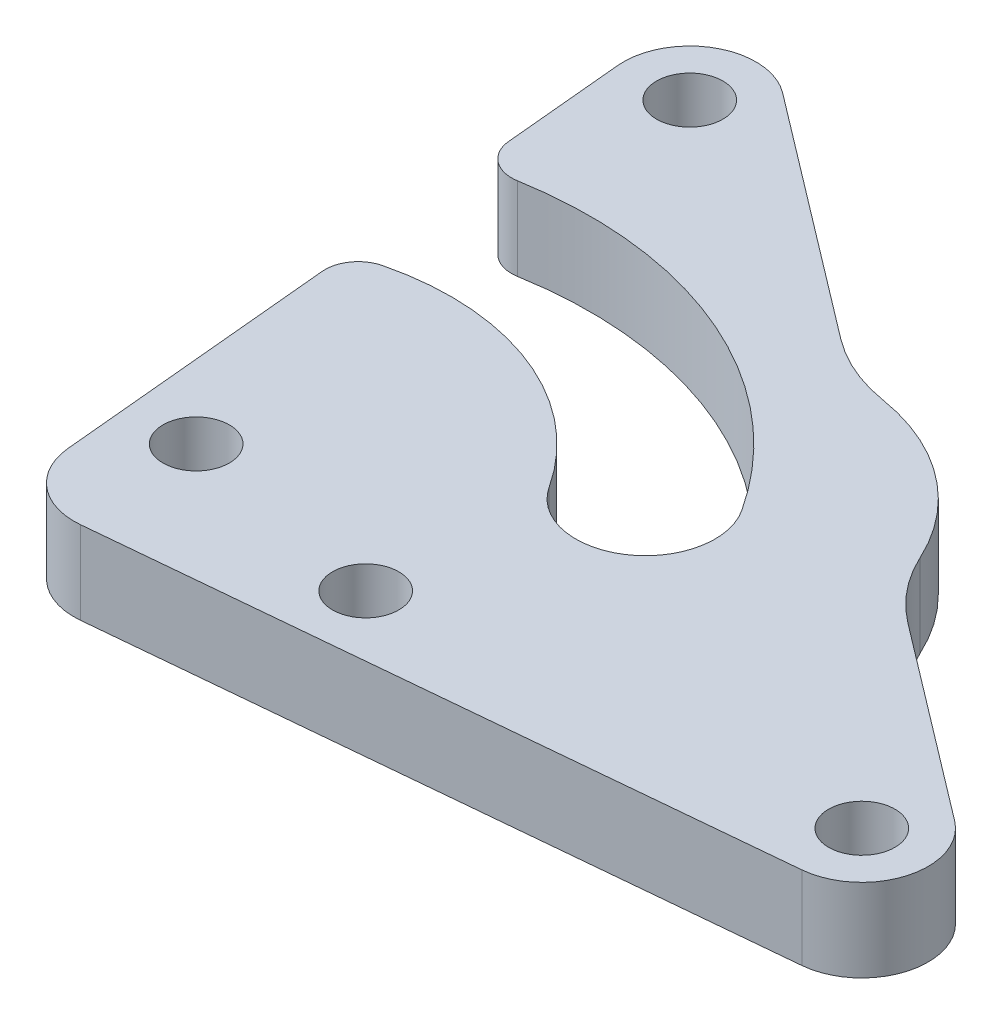
ISO-10303-21;
HEADER;
FILE_DESCRIPTION(('STEP AP214'),'2;1');
FILE_NAME('part.step','',(''),(''),'','','');
FILE_SCHEMA(('AUTOMOTIVE_DESIGN { 1 0 10303 214 1 1 1 1 }'));
ENDSEC;
DATA;
#1=APPLICATION_CONTEXT('core data for automotive mechanical design processes');
#2=APPLICATION_PROTOCOL_DEFINITION('international standard','automotive_design',2000,#1);
#3=PRODUCT_CONTEXT('',#1,'mechanical');
#4=PRODUCT('Part','Part','',(#3));
#5=PRODUCT_RELATED_PRODUCT_CATEGORY('part','',(#4));
#6=PRODUCT_DEFINITION_FORMATION('','',#4);
#7=PRODUCT_DEFINITION_CONTEXT('part definition',#1,'design');
#8=PRODUCT_DEFINITION('design','',#6,#7);
#9=PRODUCT_DEFINITION_SHAPE('','',#8);
#10=(LENGTH_UNIT() NAMED_UNIT(*) SI_UNIT(.MILLI.,.METRE.));
#11=(NAMED_UNIT(*) PLANE_ANGLE_UNIT() SI_UNIT($,.RADIAN.));
#12=(NAMED_UNIT(*) SI_UNIT($,.STERADIAN.) SOLID_ANGLE_UNIT());
#13=UNCERTAINTY_MEASURE_WITH_UNIT(LENGTH_MEASURE(1.E-05),#10,'distance_accuracy_value','');
#14=(GEOMETRIC_REPRESENTATION_CONTEXT(3) GLOBAL_UNCERTAINTY_ASSIGNED_CONTEXT((#13)) GLOBAL_UNIT_ASSIGNED_CONTEXT((#10,
#11,#12)) REPRESENTATION_CONTEXT('',''));
#15=CARTESIAN_POINT('',(0.,0.,0.));
#16=DIRECTION('',(0.,0.,1.));
#17=DIRECTION('',(1.,0.,0.));
#18=AXIS2_PLACEMENT_3D('',#15,#16,#17);
#19=CARTESIAN_POINT('',(9.77368523942251,5.,-12.861532423352));
#20=DIRECTION('',(0.605040910881647,0.,-0.796194383401131));
#21=DIRECTION('',(-0.796194383401131,0.,-0.605040910881647));
#22=AXIS2_PLACEMENT_3D('',#19,#20,#21);
#23=PLANE('',#22);
#24=DIRECTION('',(0.796194383401131,0.,0.605040910881647));
#25=VECTOR('',#24,1.);
#26=CARTESIAN_POINT('',(9.77368523942251,5.,-12.861532423352));
#27=LINE('',#26,#25);
#28=CARTESIAN_POINT('',(-20.7448000403564,5.,-36.0530199763391));
#29=VERTEX_POINT('',#28);
#30=CARTESIAN_POINT('',(-6.11267169070397,5.,-24.9338304299459));
#31=VERTEX_POINT('',#30);
#32=EDGE_CURVE('E207',#29,#31,#27,.T.);
#33=ORIENTED_EDGE('',*,*,#32,.T.);
#34=DIRECTION('',(0.,-1.,0.));
#35=VECTOR('',#34,1.);
#36=CARTESIAN_POINT('',(-6.11267169070397,0.,-24.9338304299459));
#37=LINE('',#36,#35);
#38=CARTESIAN_POINT('',(-6.11267169070397,0.,-24.9338304299459));
#39=VERTEX_POINT('',#38);
#40=EDGE_CURVE('E264',#31,#39,#37,.T.);
#41=ORIENTED_EDGE('',*,*,#40,.T.);
#42=DIRECTION('',(0.796194383401131,0.,0.605040910881647));
#43=VECTOR('',#42,1.);
#44=CARTESIAN_POINT('',(9.77368523942251,0.,-12.861532423352));
#45=LINE('',#44,#43);
#46=CARTESIAN_POINT('',(-20.7448000403564,0.,-36.0530199763391));
#47=VERTEX_POINT('',#46);
#48=EDGE_CURVE('E231',#47,#39,#45,.T.);
#49=ORIENTED_EDGE('',*,*,#48,.F.);
#50=DIRECTION('',(0.,-1.,0.));
#51=VECTOR('',#50,1.);
#52=CARTESIAN_POINT('',(-20.7448000403564,5.,-36.0530199763391));
#53=LINE('',#52,#51);
#54=EDGE_CURVE('E257',#29,#47,#53,.T.);
#55=ORIENTED_EDGE('',*,*,#54,.F.);
#56=EDGE_LOOP('',(#33,#41,#49,#55));
#57=FACE_BOUND('',#56,.T.);
#58=ADVANCED_FACE('F36',(#57),#23,.T.);
#59=CARTESIAN_POINT('',(-23.8955117873169,5.,2.23734414340496));
#60=DIRECTION('',(-0.995645293915383,0.,0.0932225761505825));
#61=DIRECTION('',(0.0932225761505825,0.,0.995645293915383));
#62=AXIS2_PLACEMENT_3D('',#59,#60,#61);
#63=PLANE('',#62);
#64=DIRECTION('',(-0.0932225761505825,0.,-0.995645293915383));
#65=VECTOR('',#64,1.);
#66=CARTESIAN_POINT('',(-23.8955117873169,5.,2.23734414340496));
#67=LINE('',#66,#65);
#68=CARTESIAN_POINT('',(-23.7209626279776,5.,4.10158193031544));
#69=VERTEX_POINT('',#68);
#70=CARTESIAN_POINT('',(-25.3052715150428,5.,-12.8193159106408));
#71=VERTEX_POINT('',#70);
#72=EDGE_CURVE('E215',#69,#71,#67,.T.);
#73=ORIENTED_EDGE('',*,*,#72,.T.);
#74=DIRECTION('',(0.,1.,0.));
#75=VECTOR('',#74,1.);
#76=CARTESIAN_POINT('',(-25.3052715150428,5.,-12.8193159106408));
#77=LINE('',#76,#75);
#78=CARTESIAN_POINT('',(-25.3052715150428,0.,-12.8193159106408));
#79=VERTEX_POINT('',#78);
#80=EDGE_CURVE('E277',#71,#79,#77,.F.);
#81=ORIENTED_EDGE('',*,*,#80,.T.);
#82=DIRECTION('',(-0.0932225761505825,0.,-0.995645293915383));
#83=VECTOR('',#82,1.);
#84=CARTESIAN_POINT('',(-23.8955117873169,0.,2.23734414340496));
#85=LINE('',#84,#83);
#86=CARTESIAN_POINT('',(-23.7209626279776,0.,4.10158193031544));
#87=VERTEX_POINT('',#86);
#88=EDGE_CURVE('E238',#87,#79,#85,.T.);
#89=ORIENTED_EDGE('',*,*,#88,.F.);
#90=DIRECTION('',(0.,1.,0.));
#91=VECTOR('',#90,1.);
#92=CARTESIAN_POINT('',(-23.7209626279776,0.,4.10158193031544));
#93=LINE('',#92,#91);
#94=EDGE_CURVE('E194',#87,#69,#93,.T.);
#95=ORIENTED_EDGE('',*,*,#94,.T.);
#96=EDGE_LOOP('',(#73,#81,#89,#95));
#97=FACE_BOUND('',#96,.T.);
#98=ADVANCED_FACE('F307',(#97),#63,.T.);
#99=CARTESIAN_POINT('',(0.,5.,0.));
#100=DIRECTION('',(0.,1.,0.));
#101=DIRECTION('',(0.,0.,1.));
#102=AXIS2_PLACEMENT_3D('',#99,#100,#101);
#103=PLANE('',#102);
#104=CARTESIAN_POINT('',(-7.29280895681746,5.,2.56347693996325));
#105=DIRECTION('',(0.,1.,0.));
#106=DIRECTION('',(0.,0.,1.));
#107=AXIS2_PLACEMENT_3D('',#104,#105,#106);
#108=CIRCLE('',#107,2.);
#109=CARTESIAN_POINT('',(-7.29280895681746,5.,4.56347693996326));
#110=VERTEX_POINT('',#109);
#111=EDGE_CURVE('E345',#110,#110,#108,.T.);
#112=ORIENTED_EDGE('',*,*,#111,.F.);
#113=EDGE_LOOP('',(#112));
#114=FACE_BOUND('',#113,.T.);
#115=CARTESIAN_POINT('',(-20.0875,5.,0.));
#116=DIRECTION('',(0.,1.,0.));
#117=DIRECTION('',(0.,0.,1.));
#118=AXIS2_PLACEMENT_3D('',#115,#116,#117);
#119=CIRCLE('',#118,2.);
#120=CARTESIAN_POINT('',(-20.0875,5.,1.99999999999999));
#121=VERTEX_POINT('',#120);
#122=EDGE_CURVE('E221',#121,#121,#119,.T.);
#123=ORIENTED_EDGE('',*,*,#122,.F.);
#124=EDGE_LOOP('',(#123));
#125=FACE_BOUND('',#124,.T.);
#126=CARTESIAN_POINT('',(20.0875,5.,0.));
#127=DIRECTION('',(0.,1.,0.));
#128=DIRECTION('',(0.,0.,1.));
#129=AXIS2_PLACEMENT_3D('',#126,#127,#128);
#130=CIRCLE('',#129,2.);
#131=CARTESIAN_POINT('',(20.0875,5.,1.99999999999999));
#132=VERTEX_POINT('',#131);
#133=EDGE_CURVE('E224',#132,#132,#130,.T.);
#134=ORIENTED_EDGE('',*,*,#133,.F.);
#135=EDGE_LOOP('',(#134));
#136=FACE_BOUND('',#135,.T.);
#137=CARTESIAN_POINT('',(-23.164963683883,5.,-32.8682424427346));
#138=DIRECTION('',(0.,1.,0.));
#139=DIRECTION('',(0.,0.,1.));
#140=AXIS2_PLACEMENT_3D('',#137,#138,#139);
#141=CIRCLE('',#140,2.);
#142=CARTESIAN_POINT('',(-23.164963683883,5.,-30.8682424427346));
#143=VERTEX_POINT('',#142);
#144=EDGE_CURVE('E227',#143,#143,#141,.T.);
#145=ORIENTED_EDGE('',*,*,#144,.F.);
#146=EDGE_LOOP('',(#145));
#147=FACE_BOUND('',#146,.T.);
#148=CARTESIAN_POINT('',(-20.0875,5.,0.));
#149=DIRECTION('',(0.,1.,0.));
#150=DIRECTION('',(0.,0.,1.));
#151=AXIS2_PLACEMENT_3D('',#148,#149,#150);
#152=CIRCLE('',#151,15.4);
#153=CARTESIAN_POINT('',(-7.1769141892076,5.,-8.39504461108851));
#154=VERTEX_POINT('',#153);
#155=CARTESIAN_POINT('',(-23.7955452447063,5.,-14.9469194305452));
#156=VERTEX_POINT('',#155);
#157=EDGE_CURVE('E156',#154,#156,#152,.T.);
#158=ORIENTED_EDGE('',*,*,#157,.T.);
#159=CARTESIAN_POINT('',(-23.313980927212,5.,-13.005761062942));
#160=DIRECTION('',(0.,1.,0.));
#161=DIRECTION('',(0.,0.,1.));
#162=AXIS2_PLACEMENT_3D('',#159,#160,#161);
#163=CIRCLE('',#162,2.);
#164=EDGE_CURVE('E286',#156,#71,#163,.T.);
#165=ORIENTED_EDGE('',*,*,#164,.T.);
#166=ORIENTED_EDGE('',*,*,#72,.F.);
#167=CARTESIAN_POINT('',(-19.7383814523161,5.,3.7286916257131));
#168=DIRECTION('',(0.,1.,0.));
#169=DIRECTION('',(0.,0.,1.));
#170=AXIS2_PLACEMENT_3D('',#167,#168,#169);
#171=CIRCLE('',#170,4.);
#172=CARTESIAN_POINT('',(-19.3655127528816,5.,7.71127482421405));
#173=VERTEX_POINT('',#172);
#174=EDGE_CURVE('E185',#69,#173,#171,.T.);
#175=ORIENTED_EDGE('',*,*,#174,.T.);
#176=DIRECTION('',(0.995645799625237,0.,-0.0932171748586161));
#177=VECTOR('',#176,1.);
#178=CARTESIAN_POINT('',(0.547417859354653,5.,5.84692995827176));
#179=LINE('',#178,#177);
#180=CARTESIAN_POINT('',(20.4603686994345,5.,3.98258319850094));
#181=VERTEX_POINT('',#180);
#182=EDGE_CURVE('E191',#173,#181,#179,.T.);
#183=ORIENTED_EDGE('',*,*,#182,.T.);
#184=CARTESIAN_POINT('',(20.0875,5.,0.));
#185=DIRECTION('',(0.,1.,0.));
#186=DIRECTION('',(0.,0.,1.));
#187=AXIS2_PLACEMENT_3D('',#184,#185,#186);
#188=CIRCLE('',#187,4.);
#189=CARTESIAN_POINT('',(22.5076636435266,5.,-3.18477753360454));
#190=VERTEX_POINT('',#189);
#191=EDGE_CURVE('E218',#181,#190,#188,.T.);
#192=ORIENTED_EDGE('',*,*,#191,.T.);
#193=CARTESIAN_POINT('',(10.7307844322284,5.,-12.1342173612366));
#194=VERTEX_POINT('',#193);
#195=EDGE_CURVE('E211',#194,#190,#27,.T.);
#196=ORIENTED_EDGE('',*,*,#195,.F.);
#197=CARTESIAN_POINT('',(16.7811935410449,5.,-20.0961611952479));
#198=DIRECTION('',(0.,1.,0.));
#199=DIRECTION('',(0.,0.,1.));
#200=AXIS2_PLACEMENT_3D('',#197,#198,#199);
#201=CIRCLE('',#200,10.);
#202=CARTESIAN_POINT('',(7.69806515314992,5.,-15.9132461006019));
#203=VERTEX_POINT('',#202);
#204=EDGE_CURVE('E273',#194,#203,#201,.F.);
#205=ORIENTED_EDGE('',*,*,#204,.T.);
#206=CARTESIAN_POINT('',(-3.65584533171876,5.,-10.6846022322945));
#207=DIRECTION('',(0.,1.,0.));
#208=DIRECTION('',(0.,0.,1.));
#209=AXIS2_PLACEMENT_3D('',#206,#207,#208);
#210=CIRCLE('',#209,12.5);
#211=CARTESIAN_POINT('',(-1.65941047070139,5.,-23.0241422498849));
#212=VERTEX_POINT('',#211);
#213=EDGE_CURVE('E178',#203,#212,#210,.T.);
#214=ORIENTED_EDGE('',*,*,#213,.T.);
#215=CARTESIAN_POINT('',(-0.0622625818874969,5.,-32.8957742639572));
#216=DIRECTION('',(0.,1.,0.));
#217=DIRECTION('',(0.,0.,1.));
#218=AXIS2_PLACEMENT_3D('',#215,#216,#217);
#219=CIRCLE('',#218,10.);
#220=EDGE_CURVE('E269',#212,#31,#219,.F.);
#221=ORIENTED_EDGE('',*,*,#220,.T.);
#222=ORIENTED_EDGE('',*,*,#32,.F.);
#223=CARTESIAN_POINT('',(-23.164963683883,5.,-32.8682424427346));
#224=DIRECTION('',(0.,1.,0.));
#225=DIRECTION('',(0.,0.,1.));
#226=AXIS2_PLACEMENT_3D('',#223,#224,#225);
#227=CIRCLE('',#226,4.);
#228=CARTESIAN_POINT('',(-27.1475448595446,5.,-32.4953521381323));
#229=VERTEX_POINT('',#228);
#230=EDGE_CURVE('E210',#29,#229,#227,.T.);
#231=ORIENTED_EDGE('',*,*,#230,.T.);
#232=CARTESIAN_POINT('',(-26.4679861947594,5.,-25.2374601717068));
#233=VERTEX_POINT('',#232);
#234=EDGE_CURVE('E214',#233,#229,#67,.T.);
#235=ORIENTED_EDGE('',*,*,#234,.F.);
#236=CARTESIAN_POINT('',(-24.4766956069286,5.,-25.4239053240079));
#237=DIRECTION('',(0.,1.,0.));
#238=DIRECTION('',(0.,0.,1.));
#239=AXIS2_PLACEMENT_3D('',#236,#237,#238);
#240=CIRCLE('',#239,2.);
#241=CARTESIAN_POINT('',(-24.1364478854613,5.,-23.4530599500538));
#242=VERTEX_POINT('',#241);
#243=EDGE_CURVE('E51',#233,#242,#240,.T.);
#244=ORIENTED_EDGE('',*,*,#243,.T.);
#245=CARTESIAN_POINT('',(-20.0875,5.,0.));
#246=DIRECTION('',(0.,1.,0.));
#247=DIRECTION('',(0.,0.,1.));
#248=AXIS2_PLACEMENT_3D('',#245,#246,#247);
#249=CIRCLE('',#248,23.8);
#250=CARTESIAN_POINT('',(-0.134776474229926,5.,-12.9741598535004));
#251=VERTEX_POINT('',#250);
#252=EDGE_CURVE('E173',#251,#242,#249,.T.);
#253=ORIENTED_EDGE('',*,*,#252,.F.);
#254=CARTESIAN_POINT('',(-3.65584533171876,5.,-10.6846022322945));
#255=DIRECTION('',(0.,1.,0.));
#256=DIRECTION('',(0.,0.,1.));
#257=AXIS2_PLACEMENT_3D('',#254,#255,#256);
#258=CIRCLE('',#257,4.2);
#259=EDGE_CURVE('E175',#154,#251,#258,.T.);
#260=ORIENTED_EDGE('',*,*,#259,.F.);
#261=EDGE_LOOP('',(#158,#165,#166,#175,#183,#192,#196,#205,#214,#221,#222,#231,#235,#244,#253,#260));
#262=FACE_BOUND('',#261,.T.);
#263=ADVANCED_FACE('F314',(#114,#125,#136,#147,#262),#103,.T.);
#264=CARTESIAN_POINT('',(0.,0.,0.));
#265=DIRECTION('',(0.,1.,0.));
#266=DIRECTION('',(0.,0.,1.));
#267=AXIS2_PLACEMENT_3D('',#264,#265,#266);
#268=PLANE('',#267);
#269=CARTESIAN_POINT('',(-7.29280895681746,0.,2.56347693996325));
#270=DIRECTION('',(0.,1.,0.));
#271=DIRECTION('',(0.,0.,1.));
#272=AXIS2_PLACEMENT_3D('',#269,#270,#271);
#273=CIRCLE('',#272,2.);
#274=CARTESIAN_POINT('',(-7.29280895681746,0.,4.56347693996326));
#275=VERTEX_POINT('',#274);
#276=EDGE_CURVE('E343',#275,#275,#273,.T.);
#277=ORIENTED_EDGE('',*,*,#276,.T.);
#278=EDGE_LOOP('',(#277));
#279=FACE_BOUND('',#278,.T.);
#280=CARTESIAN_POINT('',(-23.164963683883,0.,-32.8682424427346));
#281=DIRECTION('',(0.,1.,0.));
#282=DIRECTION('',(0.,0.,1.));
#283=AXIS2_PLACEMENT_3D('',#280,#281,#282);
#284=CIRCLE('',#283,2.);
#285=CARTESIAN_POINT('',(-23.164963683883,0.,-30.8682424427346));
#286=VERTEX_POINT('',#285);
#287=EDGE_CURVE('E249',#286,#286,#284,.T.);
#288=ORIENTED_EDGE('',*,*,#287,.T.);
#289=EDGE_LOOP('',(#288));
#290=FACE_BOUND('',#289,.T.);
#291=CARTESIAN_POINT('',(20.0875,0.,0.));
#292=DIRECTION('',(0.,1.,0.));
#293=DIRECTION('',(0.,0.,1.));
#294=AXIS2_PLACEMENT_3D('',#291,#292,#293);
#295=CIRCLE('',#294,2.);
#296=CARTESIAN_POINT('',(20.0875,0.,1.99999999999999));
#297=VERTEX_POINT('',#296);
#298=EDGE_CURVE('E246',#297,#297,#295,.T.);
#299=ORIENTED_EDGE('',*,*,#298,.T.);
#300=EDGE_LOOP('',(#299));
#301=FACE_BOUND('',#300,.T.);
#302=CARTESIAN_POINT('',(-20.0875,0.,0.));
#303=DIRECTION('',(0.,1.,0.));
#304=DIRECTION('',(0.,0.,1.));
#305=AXIS2_PLACEMENT_3D('',#302,#303,#304);
#306=CIRCLE('',#305,2.);
#307=CARTESIAN_POINT('',(-20.0875,0.,1.99999999999999));
#308=VERTEX_POINT('',#307);
#309=EDGE_CURVE('E243',#308,#308,#306,.T.);
#310=ORIENTED_EDGE('',*,*,#309,.T.);
#311=EDGE_LOOP('',(#310));
#312=FACE_BOUND('',#311,.T.);
#313=ORIENTED_EDGE('',*,*,#88,.T.);
#314=CARTESIAN_POINT('',(-23.313980927212,0.,-13.005761062942));
#315=DIRECTION('',(0.,1.,0.));
#316=DIRECTION('',(0.,0.,1.));
#317=AXIS2_PLACEMENT_3D('',#314,#315,#316);
#318=CIRCLE('',#317,2.);
#319=CARTESIAN_POINT('',(-23.7955452447063,0.,-14.9469194305452));
#320=VERTEX_POINT('',#319);
#321=EDGE_CURVE('E172',#79,#320,#318,.F.);
#322=ORIENTED_EDGE('',*,*,#321,.T.);
#323=CARTESIAN_POINT('',(-20.0875,0.,0.));
#324=DIRECTION('',(0.,1.,0.));
#325=DIRECTION('',(0.,0.,1.));
#326=AXIS2_PLACEMENT_3D('',#323,#324,#325);
#327=CIRCLE('',#326,15.4);
#328=CARTESIAN_POINT('',(-7.1769141892076,0.,-8.39504461108851));
#329=VERTEX_POINT('',#328);
#330=EDGE_CURVE('E153',#329,#320,#327,.T.);
#331=ORIENTED_EDGE('',*,*,#330,.F.);
#332=CARTESIAN_POINT('',(-3.65584533171876,0.,-10.6846022322945));
#333=DIRECTION('',(0.,1.,0.));
#334=DIRECTION('',(0.,0.,1.));
#335=AXIS2_PLACEMENT_3D('',#332,#333,#334);
#336=CIRCLE('',#335,4.2);
#337=CARTESIAN_POINT('',(-0.134776474229925,0.,-12.9741598535004));
#338=VERTEX_POINT('',#337);
#339=EDGE_CURVE('E165',#329,#338,#336,.T.);
#340=ORIENTED_EDGE('',*,*,#339,.T.);
#341=CARTESIAN_POINT('',(-20.0875,0.,0.));
#342=DIRECTION('',(0.,1.,0.));
#343=DIRECTION('',(0.,0.,1.));
#344=AXIS2_PLACEMENT_3D('',#341,#342,#343);
#345=CIRCLE('',#344,23.8);
#346=CARTESIAN_POINT('',(-24.1364478854613,0.,-23.4530599500538));
#347=VERTEX_POINT('',#346);
#348=EDGE_CURVE('E161',#338,#347,#345,.T.);
#349=ORIENTED_EDGE('',*,*,#348,.T.);
#350=CARTESIAN_POINT('',(-24.4766956069286,0.,-25.4239053240079));
#351=DIRECTION('',(0.,1.,0.));
#352=DIRECTION('',(0.,0.,1.));
#353=AXIS2_PLACEMENT_3D('',#350,#351,#352);
#354=CIRCLE('',#353,2.);
#355=CARTESIAN_POINT('',(-26.4679861947594,0.,-25.2374601717068));
#356=VERTEX_POINT('',#355);
#357=EDGE_CURVE('E280',#347,#356,#354,.F.);
#358=ORIENTED_EDGE('',*,*,#357,.T.);
#359=CARTESIAN_POINT('',(-27.1475448595446,0.,-32.4953521381323));
#360=VERTEX_POINT('',#359);
#361=EDGE_CURVE('E237',#356,#360,#85,.T.);
#362=ORIENTED_EDGE('',*,*,#361,.T.);
#363=CARTESIAN_POINT('',(-23.164963683883,0.,-32.8682424427346));
#364=DIRECTION('',(0.,1.,0.));
#365=DIRECTION('',(0.,0.,1.));
#366=AXIS2_PLACEMENT_3D('',#363,#364,#365);
#367=CIRCLE('',#366,4.);
#368=EDGE_CURVE('E234',#47,#360,#367,.T.);
#369=ORIENTED_EDGE('',*,*,#368,.F.);
#370=ORIENTED_EDGE('',*,*,#48,.T.);
#371=CARTESIAN_POINT('',(-0.0622625818874969,0.,-32.8957742639572));
#372=DIRECTION('',(0.,1.,0.));
#373=DIRECTION('',(0.,0.,1.));
#374=AXIS2_PLACEMENT_3D('',#371,#372,#373);
#375=CIRCLE('',#374,10.);
#376=CARTESIAN_POINT('',(-1.65941047070139,0.,-23.0241422498849));
#377=VERTEX_POINT('',#376);
#378=EDGE_CURVE('E271',#39,#377,#375,.T.);
#379=ORIENTED_EDGE('',*,*,#378,.T.);
#380=CARTESIAN_POINT('',(-3.65584533171876,0.,-10.6846022322945));
#381=DIRECTION('',(0.,1.,0.));
#382=DIRECTION('',(0.,0.,1.));
#383=AXIS2_PLACEMENT_3D('',#380,#381,#382);
#384=CIRCLE('',#383,12.5);
#385=CARTESIAN_POINT('',(7.69806515314992,0.,-15.9132461006019));
#386=VERTEX_POINT('',#385);
#387=EDGE_CURVE('E183',#386,#377,#384,.T.);
#388=ORIENTED_EDGE('',*,*,#387,.F.);
#389=CARTESIAN_POINT('',(16.7811935410449,0.,-20.0961611952479));
#390=DIRECTION('',(0.,1.,0.));
#391=DIRECTION('',(0.,0.,1.));
#392=AXIS2_PLACEMENT_3D('',#389,#390,#391);
#393=CIRCLE('',#392,10.);
#394=CARTESIAN_POINT('',(10.7307844322284,0.,-12.1342173612366));
#395=VERTEX_POINT('',#394);
#396=EDGE_CURVE('E275',#386,#395,#393,.T.);
#397=ORIENTED_EDGE('',*,*,#396,.T.);
#398=CARTESIAN_POINT('',(22.5076636435266,0.,-3.18477753360454));
#399=VERTEX_POINT('',#398);
#400=EDGE_CURVE('E202',#395,#399,#45,.T.);
#401=ORIENTED_EDGE('',*,*,#400,.T.);
#402=CARTESIAN_POINT('',(20.0875,0.,0.));
#403=DIRECTION('',(0.,1.,0.));
#404=DIRECTION('',(0.,0.,1.));
#405=AXIS2_PLACEMENT_3D('',#402,#403,#404);
#406=CIRCLE('',#405,4.);
#407=CARTESIAN_POINT('',(20.4603686994345,0.,3.98258319850094));
#408=VERTEX_POINT('',#407);
#409=EDGE_CURVE('E240',#408,#399,#406,.T.);
#410=ORIENTED_EDGE('',*,*,#409,.F.);
#411=DIRECTION('',(0.995645799625237,0.,-0.0932171748586161));
#412=VECTOR('',#411,1.);
#413=CARTESIAN_POINT('',(0.547417859354653,0.,5.84692995827176));
#414=LINE('',#413,#412);
#415=CARTESIAN_POINT('',(-19.3655127528816,0.,7.71127482421405));
#416=VERTEX_POINT('',#415);
#417=EDGE_CURVE('E190',#416,#408,#414,.T.);
#418=ORIENTED_EDGE('',*,*,#417,.F.);
#419=CARTESIAN_POINT('',(-19.7383814523161,0.,3.7286916257131));
#420=DIRECTION('',(0.,1.,0.));
#421=DIRECTION('',(0.,0.,1.));
#422=AXIS2_PLACEMENT_3D('',#419,#420,#421);
#423=CIRCLE('',#422,4.);
#424=EDGE_CURVE('E187',#87,#416,#423,.T.);
#425=ORIENTED_EDGE('',*,*,#424,.F.);
#426=EDGE_LOOP('',(#313,#322,#331,#340,#349,#358,#362,#369,#370,#379,#388,#397,#401,#410,#418,#425));
#427=FACE_BOUND('',#426,.T.);
#428=ADVANCED_FACE('F171',(#279,#290,#301,#312,#427),#268,.F.);
#429=ORIENTED_EDGE('',*,*,#400,.F.);
#430=DIRECTION('',(0.,-1.,0.));
#431=VECTOR('',#430,1.);
#432=CARTESIAN_POINT('',(10.7307844322284,5.,-12.1342173612366));
#433=LINE('',#432,#431);
#434=EDGE_CURVE('E266',#395,#194,#433,.F.);
#435=ORIENTED_EDGE('',*,*,#434,.T.);
#436=ORIENTED_EDGE('',*,*,#195,.T.);
#437=DIRECTION('',(0.,-1.,0.));
#438=VECTOR('',#437,1.);
#439=CARTESIAN_POINT('',(22.5076636435266,5.,-3.18477753360454));
#440=LINE('',#439,#438);
#441=EDGE_CURVE('E230',#190,#399,#440,.T.);
#442=ORIENTED_EDGE('',*,*,#441,.T.);
#443=EDGE_LOOP('',(#429,#435,#436,#442));
#444=FACE_BOUND('',#443,.T.);
#445=ADVANCED_FACE('F310',(#444),#23,.T.);
#446=CARTESIAN_POINT('',(-23.164963683883,5.,-32.8682424427346));
#447=DIRECTION('',(0.,-1.,0.));
#448=DIRECTION('',(0.,0.,-1.));
#449=AXIS2_PLACEMENT_3D('',#446,#447,#448);
#450=CYLINDRICAL_SURFACE('',#449,4.);
#451=ORIENTED_EDGE('',*,*,#368,.T.);
#452=DIRECTION('',(0.,-1.,0.));
#453=VECTOR('',#452,1.);
#454=CARTESIAN_POINT('',(-27.1475448595446,5.,-32.4953521381323));
#455=LINE('',#454,#453);
#456=EDGE_CURVE('E254',#229,#360,#455,.T.);
#457=ORIENTED_EDGE('',*,*,#456,.F.);
#458=ORIENTED_EDGE('',*,*,#230,.F.);
#459=ORIENTED_EDGE('',*,*,#54,.T.);
#460=EDGE_LOOP('',(#451,#457,#458,#459));
#461=FACE_BOUND('',#460,.T.);
#462=ADVANCED_FACE('F320',(#461),#450,.T.);
#463=ORIENTED_EDGE('',*,*,#361,.F.);
#464=DIRECTION('',(0.,-1.,0.));
#465=VECTOR('',#464,1.);
#466=CARTESIAN_POINT('',(-26.4679861947594,5.,-25.2374601717068));
#467=LINE('',#466,#465);
#468=EDGE_CURVE('E11',#356,#233,#467,.F.);
#469=ORIENTED_EDGE('',*,*,#468,.T.);
#470=ORIENTED_EDGE('',*,*,#234,.T.);
#471=ORIENTED_EDGE('',*,*,#456,.T.);
#472=EDGE_LOOP('',(#463,#469,#470,#471));
#473=FACE_BOUND('',#472,.T.);
#474=ADVANCED_FACE('F293',(#473),#63,.T.);
#475=CARTESIAN_POINT('',(20.0875,5.,0.));
#476=DIRECTION('',(0.,-1.,0.));
#477=DIRECTION('',(0.,0.,-1.));
#478=AXIS2_PLACEMENT_3D('',#475,#476,#477);
#479=CYLINDRICAL_SURFACE('',#478,2.);
#480=ORIENTED_EDGE('',*,*,#133,.T.);
#481=EDGE_LOOP('',(#480));
#482=FACE_BOUND('',#481,.T.);
#483=ORIENTED_EDGE('',*,*,#298,.F.);
#484=EDGE_LOOP('',(#483));
#485=FACE_BOUND('',#484,.T.);
#486=ADVANCED_FACE('F377',(#482,#485),#479,.F.);
#487=CARTESIAN_POINT('',(-20.0875,5.,0.));
#488=DIRECTION('',(0.,-1.,0.));
#489=DIRECTION('',(0.,0.,-1.));
#490=AXIS2_PLACEMENT_3D('',#487,#488,#489);
#491=CYLINDRICAL_SURFACE('',#490,2.);
#492=ORIENTED_EDGE('',*,*,#122,.T.);
#493=EDGE_LOOP('',(#492));
#494=FACE_BOUND('',#493,.T.);
#495=ORIENTED_EDGE('',*,*,#309,.F.);
#496=EDGE_LOOP('',(#495));
#497=FACE_BOUND('',#496,.T.);
#498=ADVANCED_FACE('F375',(#494,#497),#491,.F.);
#499=CARTESIAN_POINT('',(20.0875,5.,0.));
#500=DIRECTION('',(0.,-1.,0.));
#501=DIRECTION('',(0.,0.,-1.));
#502=AXIS2_PLACEMENT_3D('',#499,#500,#501);
#503=CYLINDRICAL_SURFACE('',#502,4.);
#504=ORIENTED_EDGE('',*,*,#191,.F.);
#505=DIRECTION('',(0.,1.,0.));
#506=VECTOR('',#505,1.);
#507=CARTESIAN_POINT('',(20.4603686994345,0.,3.98258319850094));
#508=LINE('',#507,#506);
#509=EDGE_CURVE('E199',#408,#181,#508,.T.);
#510=ORIENTED_EDGE('',*,*,#509,.F.);
#511=ORIENTED_EDGE('',*,*,#409,.T.);
#512=ORIENTED_EDGE('',*,*,#441,.F.);
#513=EDGE_LOOP('',(#504,#510,#511,#512));
#514=FACE_BOUND('',#513,.T.);
#515=ADVANCED_FACE('F366',(#514),#503,.T.);
#516=CARTESIAN_POINT('',(-23.164963683883,5.,-32.8682424427346));
#517=DIRECTION('',(0.,-1.,0.));
#518=DIRECTION('',(0.,0.,-1.));
#519=AXIS2_PLACEMENT_3D('',#516,#517,#518);
#520=CYLINDRICAL_SURFACE('',#519,2.);
#521=ORIENTED_EDGE('',*,*,#144,.T.);
#522=EDGE_LOOP('',(#521));
#523=FACE_BOUND('',#522,.T.);
#524=ORIENTED_EDGE('',*,*,#287,.F.);
#525=EDGE_LOOP('',(#524));
#526=FACE_BOUND('',#525,.T.);
#527=ADVANCED_FACE('F362',(#523,#526),#520,.F.);
#528=CARTESIAN_POINT('',(0.547417859354653,0.,5.84692995827176));
#529=DIRECTION('',(0.0932171748586161,0.,0.995645799625237));
#530=DIRECTION('',(0.995645799625237,0.,-0.0932171748586161));
#531=AXIS2_PLACEMENT_3D('',#528,#529,#530);
#532=PLANE('',#531);
#533=ORIENTED_EDGE('',*,*,#182,.F.);
#534=DIRECTION('',(0.,1.,0.));
#535=VECTOR('',#534,1.);
#536=CARTESIAN_POINT('',(-19.3655127528816,0.,7.71127482421405));
#537=LINE('',#536,#535);
#538=EDGE_CURVE('E203',#416,#173,#537,.T.);
#539=ORIENTED_EDGE('',*,*,#538,.F.);
#540=ORIENTED_EDGE('',*,*,#417,.T.);
#541=ORIENTED_EDGE('',*,*,#509,.T.);
#542=EDGE_LOOP('',(#533,#539,#540,#541));
#543=FACE_BOUND('',#542,.T.);
#544=ADVANCED_FACE('F365',(#543),#532,.T.);
#545=CARTESIAN_POINT('',(-19.7383814523161,0.,3.7286916257131));
#546=DIRECTION('',(0.,1.,0.));
#547=DIRECTION('',(0.,0.,1.));
#548=AXIS2_PLACEMENT_3D('',#545,#546,#547);
#549=CYLINDRICAL_SURFACE('',#548,4.);
#550=ORIENTED_EDGE('',*,*,#174,.F.);
#551=ORIENTED_EDGE('',*,*,#94,.F.);
#552=ORIENTED_EDGE('',*,*,#424,.T.);
#553=ORIENTED_EDGE('',*,*,#538,.T.);
#554=EDGE_LOOP('',(#550,#551,#552,#553));
#555=FACE_BOUND('',#554,.T.);
#556=ADVANCED_FACE('F428',(#555),#549,.T.);
#557=CARTESIAN_POINT('',(-20.0875,0.,0.));
#558=DIRECTION('',(0.,1.,0.));
#559=DIRECTION('',(0.,0.,1.));
#560=AXIS2_PLACEMENT_3D('',#557,#558,#559);
#561=CYLINDRICAL_SURFACE('',#560,15.4);
#562=ORIENTED_EDGE('',*,*,#330,.T.);
#563=DIRECTION('',(0.,1.,0.));
#564=VECTOR('',#563,1.);
#565=CARTESIAN_POINT('',(-23.7955452447063,0.,-14.9469194305452));
#566=LINE('',#565,#564);
#567=EDGE_CURVE('E283',#320,#156,#566,.T.);
#568=ORIENTED_EDGE('',*,*,#567,.T.);
#569=ORIENTED_EDGE('',*,*,#157,.F.);
#570=DIRECTION('',(0.,1.,0.));
#571=VECTOR('',#570,1.);
#572=CARTESIAN_POINT('',(-7.1769141892076,0.,-8.39504461108851));
#573=LINE('',#572,#571);
#574=EDGE_CURVE('E149',#329,#154,#573,.T.);
#575=ORIENTED_EDGE('',*,*,#574,.F.);
#576=EDGE_LOOP('',(#562,#568,#569,#575));
#577=FACE_BOUND('',#576,.T.);
#578=ADVANCED_FACE('F151',(#577),#561,.T.);
#579=CARTESIAN_POINT('',(-20.0875,0.,0.));
#580=DIRECTION('',(0.,1.,0.));
#581=DIRECTION('',(0.,0.,1.));
#582=AXIS2_PLACEMENT_3D('',#579,#580,#581);
#583=CYLINDRICAL_SURFACE('',#582,23.8);
#584=ORIENTED_EDGE('',*,*,#252,.T.);
#585=DIRECTION('',(0.,1.,0.));
#586=VECTOR('',#585,1.);
#587=CARTESIAN_POINT('',(-24.1364478854613,0.,-23.4530599500538));
#588=LINE('',#587,#586);
#589=EDGE_CURVE('E44',#242,#347,#588,.F.);
#590=ORIENTED_EDGE('',*,*,#589,.T.);
#591=ORIENTED_EDGE('',*,*,#348,.F.);
#592=DIRECTION('',(0.,1.,0.));
#593=VECTOR('',#592,1.);
#594=CARTESIAN_POINT('',(-0.134776474229926,0.,-12.9741598535004));
#595=LINE('',#594,#593);
#596=EDGE_CURVE('E160',#338,#251,#595,.T.);
#597=ORIENTED_EDGE('',*,*,#596,.T.);
#598=EDGE_LOOP('',(#584,#590,#591,#597));
#599=FACE_BOUND('',#598,.T.);
#600=ADVANCED_FACE('F290',(#599),#583,.F.);
#601=CARTESIAN_POINT('',(-3.65584533171876,0.,-10.6846022322945));
#602=DIRECTION('',(0.,1.,0.));
#603=DIRECTION('',(0.,0.,1.));
#604=AXIS2_PLACEMENT_3D('',#601,#602,#603);
#605=CYLINDRICAL_SURFACE('',#604,4.2);
#606=ORIENTED_EDGE('',*,*,#259,.T.);
#607=ORIENTED_EDGE('',*,*,#596,.F.);
#608=ORIENTED_EDGE('',*,*,#339,.F.);
#609=ORIENTED_EDGE('',*,*,#574,.T.);
#610=EDGE_LOOP('',(#606,#607,#608,#609));
#611=FACE_BOUND('',#610,.T.);
#612=ADVANCED_FACE('F166',(#611),#605,.F.);
#613=CARTESIAN_POINT('',(-3.65584533171876,0.,-10.6846022322945));
#614=DIRECTION('',(0.,1.,0.));
#615=DIRECTION('',(0.,0.,1.));
#616=AXIS2_PLACEMENT_3D('',#613,#614,#615);
#617=CYLINDRICAL_SURFACE('',#616,12.5);
#618=ORIENTED_EDGE('',*,*,#387,.T.);
#619=DIRECTION('',(0.,1.,0.));
#620=VECTOR('',#619,1.);
#621=CARTESIAN_POINT('',(-1.65941047070139,0.,-23.0241422498849));
#622=LINE('',#621,#620);
#623=EDGE_CURVE('E261',#377,#212,#622,.T.);
#624=ORIENTED_EDGE('',*,*,#623,.T.);
#625=ORIENTED_EDGE('',*,*,#213,.F.);
#626=DIRECTION('',(0.,1.,0.));
#627=VECTOR('',#626,1.);
#628=CARTESIAN_POINT('',(7.69806515314992,0.,-15.9132461006019));
#629=LINE('',#628,#627);
#630=EDGE_CURVE('E259',#203,#386,#629,.F.);
#631=ORIENTED_EDGE('',*,*,#630,.T.);
#632=EDGE_LOOP('',(#618,#624,#625,#631));
#633=FACE_BOUND('',#632,.T.);
#634=ADVANCED_FACE('F340',(#633),#617,.T.);
#635=CARTESIAN_POINT('',(-0.0622625818874969,0.,-32.8957742639572));
#636=DIRECTION('',(0.,1.,0.));
#637=DIRECTION('',(0.,0.,1.));
#638=AXIS2_PLACEMENT_3D('',#635,#636,#637);
#639=CYLINDRICAL_SURFACE('',#638,10.);
#640=ORIENTED_EDGE('',*,*,#378,.F.);
#641=ORIENTED_EDGE('',*,*,#40,.F.);
#642=ORIENTED_EDGE('',*,*,#220,.F.);
#643=ORIENTED_EDGE('',*,*,#623,.F.);
#644=EDGE_LOOP('',(#640,#641,#642,#643));
#645=FACE_BOUND('',#644,.T.);
#646=ADVANCED_FACE('F469',(#645),#639,.F.);
#647=CARTESIAN_POINT('',(16.7811935410449,0.,-20.0961611952479));
#648=DIRECTION('',(0.,1.,0.));
#649=DIRECTION('',(0.,0.,1.));
#650=AXIS2_PLACEMENT_3D('',#647,#648,#649);
#651=CYLINDRICAL_SURFACE('',#650,10.);
#652=ORIENTED_EDGE('',*,*,#396,.F.);
#653=ORIENTED_EDGE('',*,*,#630,.F.);
#654=ORIENTED_EDGE('',*,*,#204,.F.);
#655=ORIENTED_EDGE('',*,*,#434,.F.);
#656=EDGE_LOOP('',(#652,#653,#654,#655));
#657=FACE_BOUND('',#656,.T.);
#658=ADVANCED_FACE('F304',(#657),#651,.F.);
#659=CARTESIAN_POINT('',(-23.313980927212,0.,-13.005761062942));
#660=DIRECTION('',(0.,1.,0.));
#661=DIRECTION('',(0.,0.,1.));
#662=AXIS2_PLACEMENT_3D('',#659,#660,#661);
#663=CYLINDRICAL_SURFACE('',#662,2.);
#664=ORIENTED_EDGE('',*,*,#164,.F.);
#665=ORIENTED_EDGE('',*,*,#567,.F.);
#666=ORIENTED_EDGE('',*,*,#321,.F.);
#667=ORIENTED_EDGE('',*,*,#80,.F.);
#668=EDGE_LOOP('',(#664,#665,#666,#667));
#669=FACE_BOUND('',#668,.T.);
#670=ADVANCED_FACE('F297',(#669),#663,.T.);
#671=CARTESIAN_POINT('',(-24.4766956069286,0.,-25.4239053240079));
#672=DIRECTION('',(0.,1.,0.));
#673=DIRECTION('',(0.,0.,1.));
#674=AXIS2_PLACEMENT_3D('',#671,#672,#673);
#675=CYLINDRICAL_SURFACE('',#674,2.);
#676=ORIENTED_EDGE('',*,*,#243,.F.);
#677=ORIENTED_EDGE('',*,*,#468,.F.);
#678=ORIENTED_EDGE('',*,*,#357,.F.);
#679=ORIENTED_EDGE('',*,*,#589,.F.);
#680=EDGE_LOOP('',(#676,#677,#678,#679));
#681=FACE_BOUND('',#680,.T.);
#682=ADVANCED_FACE('F38',(#681),#675,.T.);
#683=CARTESIAN_POINT('',(-7.29280895681746,0.,2.56347693996325));
#684=DIRECTION('',(0.,1.,0.));
#685=DIRECTION('',(0.,0.,1.));
#686=AXIS2_PLACEMENT_3D('',#683,#684,#685);
#687=CYLINDRICAL_SURFACE('',#686,2.);
#688=ORIENTED_EDGE('',*,*,#276,.F.);
#689=EDGE_LOOP('',(#688));
#690=FACE_BOUND('',#689,.T.);
#691=ORIENTED_EDGE('',*,*,#111,.T.);
#692=EDGE_LOOP('',(#691));
#693=FACE_BOUND('',#692,.T.);
#694=ADVANCED_FACE('F296',(#690,#693),#687,.F.);
#695=CLOSED_SHELL('',(#58,#98,#263,#428,#445,#462,#474,#486,#498,#515,#527,#544,#556,#578,#600,
#612,#634,#646,#658,#670,#682,#694));
#696=MANIFOLD_SOLID_BREP('B2',#695);
#697=ADVANCED_BREP_SHAPE_REPRESENTATION('',(#18,#696),#14);
#698=SHAPE_DEFINITION_REPRESENTATION(#9,#697);
ENDSEC;
END-ISO-10303-21;
